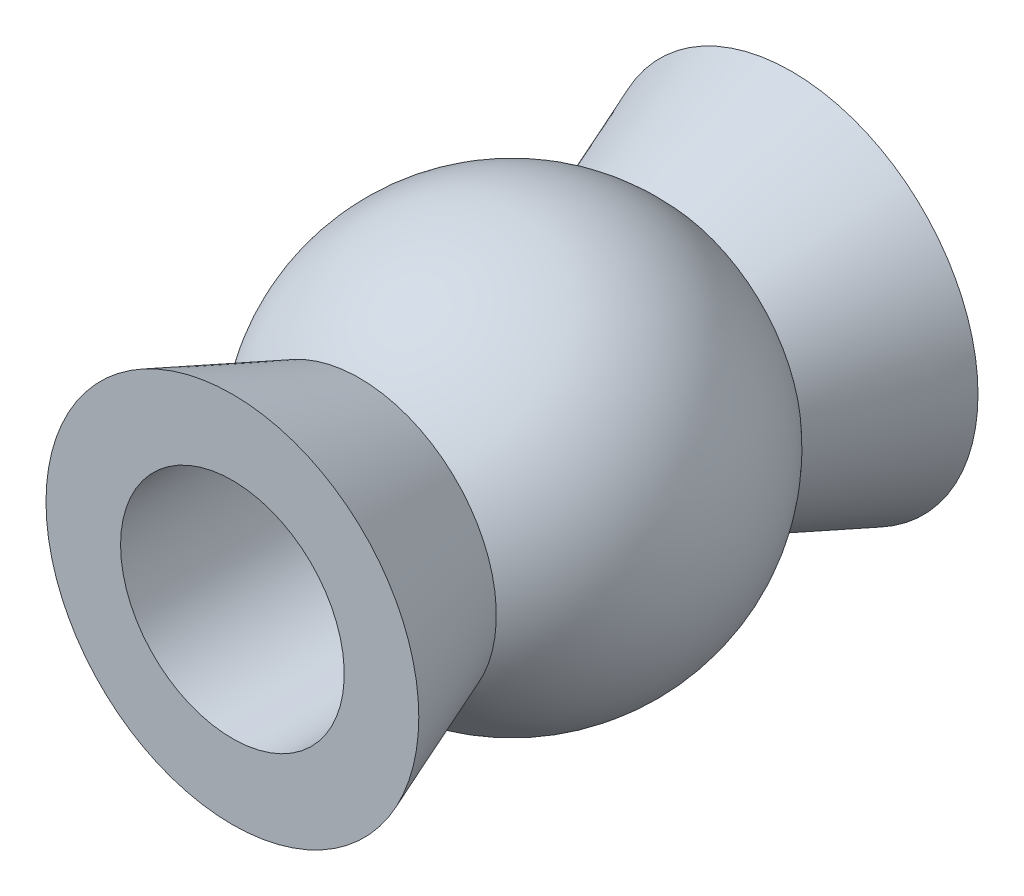
ISO-10303-21;
HEADER;
FILE_DESCRIPTION(('STEP AP214'),'2;1');
FILE_NAME('part.step','',(''),(''),'','','');
FILE_SCHEMA(('AUTOMOTIVE_DESIGN { 1 0 10303 214 1 1 1 1 }'));
ENDSEC;
DATA;
#1=APPLICATION_CONTEXT('core data for automotive mechanical design processes');
#2=APPLICATION_PROTOCOL_DEFINITION('international standard','automotive_design',2000,#1);
#3=PRODUCT_CONTEXT('',#1,'mechanical');
#4=PRODUCT('Part','Part','',(#3));
#5=PRODUCT_RELATED_PRODUCT_CATEGORY('part','',(#4));
#6=PRODUCT_DEFINITION_FORMATION('','',#4);
#7=PRODUCT_DEFINITION_CONTEXT('part definition',#1,'design');
#8=PRODUCT_DEFINITION('design','',#6,#7);
#9=PRODUCT_DEFINITION_SHAPE('','',#8);
#10=(LENGTH_UNIT() NAMED_UNIT(*) SI_UNIT(.MILLI.,.METRE.));
#11=(NAMED_UNIT(*) PLANE_ANGLE_UNIT() SI_UNIT($,.RADIAN.));
#12=(NAMED_UNIT(*) SI_UNIT($,.STERADIAN.) SOLID_ANGLE_UNIT());
#13=UNCERTAINTY_MEASURE_WITH_UNIT(LENGTH_MEASURE(1.E-05),#10,'distance_accuracy_value','');
#14=(GEOMETRIC_REPRESENTATION_CONTEXT(3) GLOBAL_UNCERTAINTY_ASSIGNED_CONTEXT((#13)) GLOBAL_UNIT_ASSIGNED_CONTEXT((#10,
#11,#12)) REPRESENTATION_CONTEXT('',''));
#15=CARTESIAN_POINT('',(0.,0.,0.));
#16=DIRECTION('',(0.,0.,1.));
#17=DIRECTION('',(1.,0.,0.));
#18=AXIS2_PLACEMENT_3D('',#15,#16,#17);
#19=CARTESIAN_POINT('',(0.,-3.88578058618805E-13,3.74999999999953));
#20=DIRECTION('',(0.,0.,-1.));
#21=DIRECTION('',(-1.00000000000001,0.,0.));
#22=AXIS2_PLACEMENT_3D('',#19,#20,#21);
#23=PLANE('',#22);
#24=CARTESIAN_POINT('',(0.,-3.88578058618805E-13,3.74999999999953));
#25=DIRECTION('',(0.,0.,-1.));
#26=DIRECTION('',(-1.00000000000001,0.,0.));
#27=AXIS2_PLACEMENT_3D('',#24,#25,#26);
#28=CIRCLE('',#27,1.5);
#29=CARTESIAN_POINT('',(-1.49999999999994,-3.86496390447633E-13,3.74999999999953));
#30=VERTEX_POINT('',#29);
#31=EDGE_CURVE('E53',#30,#30,#28,.T.);
#32=ORIENTED_EDGE('',*,*,#31,.T.);
#33=EDGE_LOOP('',(#32));
#34=FACE_BOUND('',#33,.T.);
#35=CARTESIAN_POINT('',(0.,-3.88578058618805E-13,3.74999999999953));
#36=DIRECTION('',(0.,0.,-1.));
#37=DIRECTION('',(-1.00000000000001,0.,0.));
#38=AXIS2_PLACEMENT_3D('',#35,#36,#37);
#39=CIRCLE('',#38,2.5);
#40=CARTESIAN_POINT('',(-2.49999999999995,-3.85108611666851E-13,3.74999999999953));
#41=VERTEX_POINT('',#40);
#42=EDGE_CURVE('E10',#41,#41,#39,.T.);
#43=ORIENTED_EDGE('',*,*,#42,.F.);
#44=EDGE_LOOP('',(#43));
#45=FACE_BOUND('',#44,.T.);
#46=ADVANCED_FACE('F34',(#34,#45),#23,.F.);
#47=CARTESIAN_POINT('',(0.,-3.88578058618805E-13,2.46636498283187));
#48=DIRECTION('',(0.,0.,1.));
#49=DIRECTION('',(1.00000000000001,0.,0.));
#50=AXIS2_PLACEMENT_3D('',#47,#48,#49);
#51=CONICAL_SURFACE('',#50,2.,0.371438353009826);
#52=CARTESIAN_POINT('',(0.,-4.9960036108132E-13,2.04682076809598));
#53=DIRECTION('',(0.,0.,-1.));
#54=DIRECTION('',(-1.00000000000001,0.,0.));
#55=AXIS2_PLACEMENT_3D('',#52,#53,#54);
#56=CIRCLE('',#55,1.83657963162242);
#57=CARTESIAN_POINT('',(-1.83657963162237,-4.9705159483934E-13,2.04682076809598));
#58=VERTEX_POINT('',#57);
#59=EDGE_CURVE('E40',#58,#58,#56,.T.);
#60=ORIENTED_EDGE('',*,*,#59,.F.);
#61=EDGE_LOOP('',(#60));
#62=FACE_BOUND('',#61,.T.);
#63=ORIENTED_EDGE('',*,*,#42,.T.);
#64=EDGE_LOOP('',(#63));
#65=FACE_BOUND('',#64,.T.);
#66=ADVANCED_FACE('F77',(#62,#65),#51,.T.);
#67=CARTESIAN_POINT('',(0.,0.,0.));
#68=DIRECTION('',(0.,0.,-1.));
#69=DIRECTION('',(1.00000000000001,0.,0.));
#70=AXIS2_PLACEMENT_3D('',#67,#68,#69);
#71=SPHERICAL_SURFACE('',#70,2.75);
#72=CARTESIAN_POINT('',(0.,0.,-2.04682076809631));
#73=DIRECTION('',(0.,0.,-1.));
#74=DIRECTION('',(-1.00000000000001,0.,0.));
#75=AXIS2_PLACEMENT_3D('',#72,#73,#74);
#76=CIRCLE('',#75,1.83657963162242);
#77=CARTESIAN_POINT('',(-1.83657963162239,0.,-2.04682076809631));
#78=VERTEX_POINT('',#77);
#79=EDGE_CURVE('E44',#78,#78,#76,.T.);
#80=ORIENTED_EDGE('',*,*,#79,.F.);
#81=EDGE_LOOP('',(#80));
#82=FACE_BOUND('',#81,.T.);
#83=ORIENTED_EDGE('',*,*,#59,.T.);
#84=EDGE_LOOP('',(#83));
#85=FACE_BOUND('',#84,.T.);
#86=ADVANCED_FACE('F72',(#82,#85),#71,.T.);
#87=CARTESIAN_POINT('',(0.,0.,-2.4663649828322));
#88=DIRECTION('',(0.,0.,-1.));
#89=DIRECTION('',(-1.00000000000001,0.,0.));
#90=AXIS2_PLACEMENT_3D('',#87,#88,#89);
#91=CONICAL_SURFACE('',#90,2.,0.371438353009826);
#92=CARTESIAN_POINT('',(0.,0.,-3.74999999999986));
#93=DIRECTION('',(0.,0.,-1.));
#94=DIRECTION('',(-1.00000000000001,0.,0.));
#95=AXIS2_PLACEMENT_3D('',#92,#93,#94);
#96=CIRCLE('',#95,2.5);
#97=CARTESIAN_POINT('',(-2.49999999999997,0.,-3.74999999999986));
#98=VERTEX_POINT('',#97);
#99=EDGE_CURVE('E48',#98,#98,#96,.T.);
#100=ORIENTED_EDGE('',*,*,#99,.F.);
#101=EDGE_LOOP('',(#100));
#102=FACE_BOUND('',#101,.T.);
#103=ORIENTED_EDGE('',*,*,#79,.T.);
#104=EDGE_LOOP('',(#103));
#105=FACE_BOUND('',#104,.T.);
#106=ADVANCED_FACE('F66',(#102,#105),#91,.T.);
#107=CARTESIAN_POINT('',(0.,0.,-3.74999999999986));
#108=DIRECTION('',(0.,0.,1.));
#109=DIRECTION('',(1.00000000000001,0.,0.));
#110=AXIS2_PLACEMENT_3D('',#107,#108,#109);
#111=PLANE('',#110);
#112=CARTESIAN_POINT('',(0.,0.,-3.74999999999986));
#113=DIRECTION('',(0.,0.,-1.));
#114=DIRECTION('',(-1.00000000000001,0.,0.));
#115=AXIS2_PLACEMENT_3D('',#112,#113,#114);
#116=CIRCLE('',#115,1.5);
#117=CARTESIAN_POINT('',(-1.49999999999997,0.,-3.74999999999986));
#118=VERTEX_POINT('',#117);
#119=EDGE_CURVE('E56',#118,#118,#116,.T.);
#120=ORIENTED_EDGE('',*,*,#119,.F.);
#121=EDGE_LOOP('',(#120));
#122=FACE_BOUND('',#121,.T.);
#123=ORIENTED_EDGE('',*,*,#99,.T.);
#124=EDGE_LOOP('',(#123));
#125=FACE_BOUND('',#124,.T.);
#126=ADVANCED_FACE('F63',(#122,#125),#111,.F.);
#127=CARTESIAN_POINT('',(0.,-1.80411241501588E-13,6.24999999999953));
#128=DIRECTION('',(0.,0.,-1.));
#129=DIRECTION('',(-1.00000000000001,0.,0.));
#130=AXIS2_PLACEMENT_3D('',#127,#128,#129);
#131=CYLINDRICAL_SURFACE('',#130,1.5);
#132=ORIENTED_EDGE('',*,*,#119,.T.);
#133=EDGE_LOOP('',(#132));
#134=FACE_BOUND('',#133,.T.);
#135=ORIENTED_EDGE('',*,*,#31,.F.);
#136=EDGE_LOOP('',(#135));
#137=FACE_BOUND('',#136,.T.);
#138=ADVANCED_FACE('F60',(#134,#137),#131,.F.);
#139=CLOSED_SHELL('',(#46,#66,#86,#106,#126,#138));
#140=MANIFOLD_SOLID_BREP('B2',#139);
#141=ADVANCED_BREP_SHAPE_REPRESENTATION('',(#18,#140),#14);
#142=SHAPE_DEFINITION_REPRESENTATION(#9,#141);
ENDSEC;
END-ISO-10303-21;
